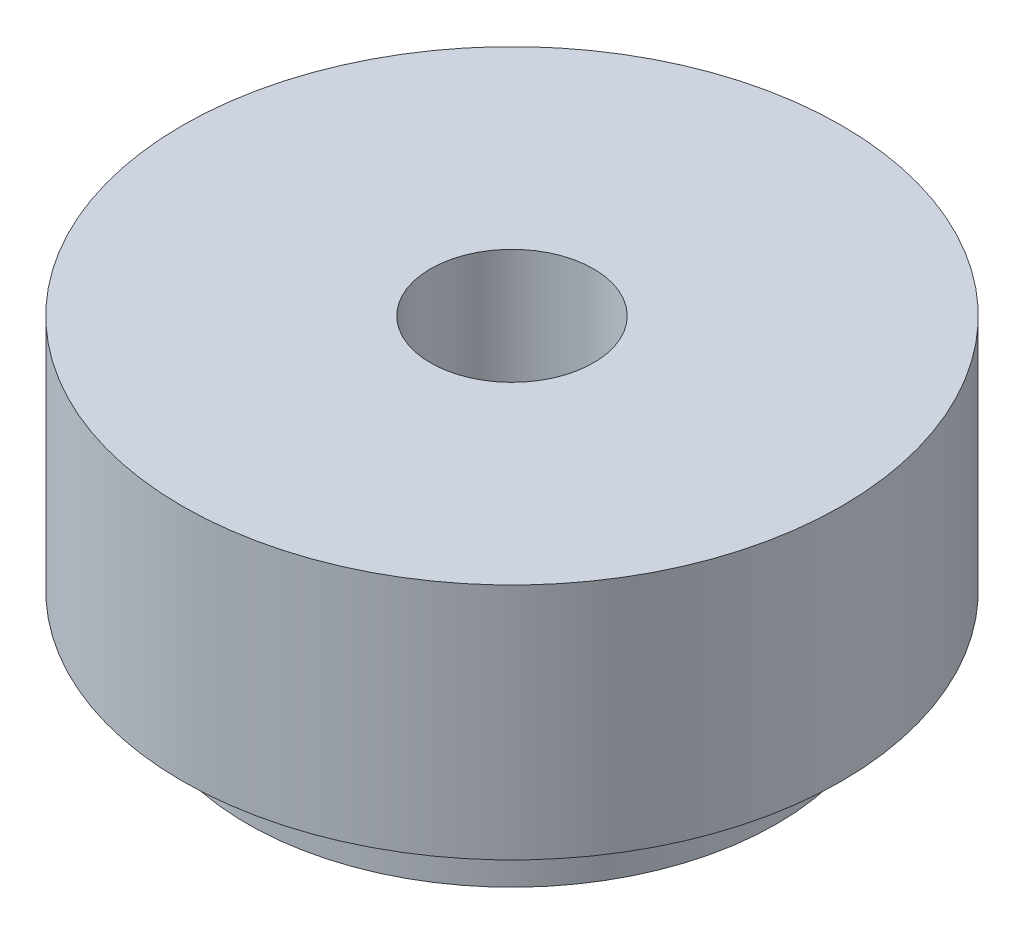
ISO-10303-21;
HEADER;
FILE_DESCRIPTION(('STEP AP214'),'2;1');
FILE_NAME('part.step','',(''),(''),'','','');
FILE_SCHEMA(('AUTOMOTIVE_DESIGN { 1 0 10303 214 1 1 1 1 }'));
ENDSEC;
DATA;
#1=APPLICATION_CONTEXT('core data for automotive mechanical design processes');
#2=APPLICATION_PROTOCOL_DEFINITION('international standard','automotive_design',2000,#1);
#3=PRODUCT_CONTEXT('',#1,'mechanical');
#4=PRODUCT('Part','Part','',(#3));
#5=PRODUCT_RELATED_PRODUCT_CATEGORY('part','',(#4));
#6=PRODUCT_DEFINITION_FORMATION('','',#4);
#7=PRODUCT_DEFINITION_CONTEXT('part definition',#1,'design');
#8=PRODUCT_DEFINITION('design','',#6,#7);
#9=PRODUCT_DEFINITION_SHAPE('','',#8);
#10=(LENGTH_UNIT() NAMED_UNIT(*) SI_UNIT(.MILLI.,.METRE.));
#11=(NAMED_UNIT(*) PLANE_ANGLE_UNIT() SI_UNIT($,.RADIAN.));
#12=(NAMED_UNIT(*) SI_UNIT($,.STERADIAN.) SOLID_ANGLE_UNIT());
#13=UNCERTAINTY_MEASURE_WITH_UNIT(LENGTH_MEASURE(1.E-05),#10,'distance_accuracy_value','');
#14=(GEOMETRIC_REPRESENTATION_CONTEXT(3) GLOBAL_UNCERTAINTY_ASSIGNED_CONTEXT((#13)) GLOBAL_UNIT_ASSIGNED_CONTEXT((#10,
#11,#12)) REPRESENTATION_CONTEXT('',''));
#15=CARTESIAN_POINT('',(0.,0.,0.));
#16=DIRECTION('',(0.,0.,1.));
#17=DIRECTION('',(1.,0.,0.));
#18=AXIS2_PLACEMENT_3D('',#15,#16,#17);
#19=CARTESIAN_POINT('',(0.,57.7437370761236,0.));
#20=DIRECTION('',(0.,1.,0.));
#21=DIRECTION('',(-1.,0.,0.));
#22=AXIS2_PLACEMENT_3D('',#19,#20,#21);
#23=CYLINDRICAL_SURFACE('',#22,3.6703);
#24=CARTESIAN_POINT('',(0.,0.,0.));
#25=DIRECTION('',(0.,1.,0.));
#26=DIRECTION('',(-1.,0.,0.));
#27=AXIS2_PLACEMENT_3D('',#24,#25,#26);
#28=CIRCLE('',#27,3.6703);
#29=CARTESIAN_POINT('',(-3.67029999999999,0.,0.));
#30=VERTEX_POINT('',#29);
#31=EDGE_CURVE('E55',#30,#30,#28,.T.);
#32=ORIENTED_EDGE('',*,*,#31,.F.);
#33=EDGE_LOOP('',(#32));
#34=FACE_BOUND('',#33,.T.);
#35=CARTESIAN_POINT('',(0.,-0.965199999999999,0.));
#36=DIRECTION('',(0.,1.,0.));
#37=DIRECTION('',(-1.,0.,0.));
#38=AXIS2_PLACEMENT_3D('',#35,#36,#37);
#39=CIRCLE('',#38,3.6703);
#40=CARTESIAN_POINT('',(-3.67029999999999,-0.9652,0.));
#41=VERTEX_POINT('',#40);
#42=EDGE_CURVE('E10',#41,#41,#39,.T.);
#43=ORIENTED_EDGE('',*,*,#42,.T.);
#44=EDGE_LOOP('',(#43));
#45=FACE_BOUND('',#44,.T.);
#46=ADVANCED_FACE('F33',(#34,#45),#23,.T.);
#47=CARTESIAN_POINT('',(3.67030000000001,-0.9652,0.));
#48=DIRECTION('',(0.,1.,0.));
#49=DIRECTION('',(-1.,0.,0.));
#50=AXIS2_PLACEMENT_3D('',#47,#48,#49);
#51=PLANE('',#50);
#52=ORIENTED_EDGE('',*,*,#42,.F.);
#53=EDGE_LOOP('',(#52));
#54=FACE_BOUND('',#53,.T.);
#55=CARTESIAN_POINT('',(0.,-0.965199999999999,0.));
#56=DIRECTION('',(0.,1.,0.));
#57=DIRECTION('',(-1.,0.,0.));
#58=AXIS2_PLACEMENT_3D('',#55,#56,#57);
#59=CIRCLE('',#58,1.1303);
#60=CARTESIAN_POINT('',(-1.13029999999999,-0.9652,0.));
#61=VERTEX_POINT('',#60);
#62=EDGE_CURVE('E39',#61,#61,#59,.T.);
#63=ORIENTED_EDGE('',*,*,#62,.T.);
#64=EDGE_LOOP('',(#63));
#65=FACE_BOUND('',#64,.T.);
#66=ADVANCED_FACE('F62',(#54,#65),#51,.F.);
#67=CARTESIAN_POINT('',(0.,57.7437370761236,0.));
#68=DIRECTION('',(0.,1.,0.));
#69=DIRECTION('',(-1.,0.,0.));
#70=AXIS2_PLACEMENT_3D('',#67,#68,#69);
#71=CYLINDRICAL_SURFACE('',#70,1.1303);
#72=ORIENTED_EDGE('',*,*,#62,.F.);
#73=EDGE_LOOP('',(#72));
#74=FACE_BOUND('',#73,.T.);
#75=CARTESIAN_POINT('',(0.,3.302,0.));
#76=DIRECTION('',(0.,1.,0.));
#77=DIRECTION('',(-1.,0.,0.));
#78=AXIS2_PLACEMENT_3D('',#75,#76,#77);
#79=CIRCLE('',#78,1.1303);
#80=CARTESIAN_POINT('',(-1.13029999999999,3.302,0.));
#81=VERTEX_POINT('',#80);
#82=EDGE_CURVE('E43',#81,#81,#79,.T.);
#83=ORIENTED_EDGE('',*,*,#82,.T.);
#84=EDGE_LOOP('',(#83));
#85=FACE_BOUND('',#84,.T.);
#86=ADVANCED_FACE('F66',(#74,#85),#71,.F.);
#87=CARTESIAN_POINT('',(1.13030000000001,3.302,0.));
#88=DIRECTION('',(0.,-1.,0.));
#89=DIRECTION('',(1.,0.,0.));
#90=AXIS2_PLACEMENT_3D('',#87,#88,#89);
#91=PLANE('',#90);
#92=ORIENTED_EDGE('',*,*,#82,.F.);
#93=EDGE_LOOP('',(#92));
#94=FACE_BOUND('',#93,.T.);
#95=CARTESIAN_POINT('',(0.,3.302,0.));
#96=DIRECTION('',(0.,1.,0.));
#97=DIRECTION('',(-1.,0.,0.));
#98=AXIS2_PLACEMENT_3D('',#95,#96,#97);
#99=CIRCLE('',#98,4.572);
#100=CARTESIAN_POINT('',(-4.572,3.302,0.));
#101=VERTEX_POINT('',#100);
#102=EDGE_CURVE('E47',#101,#101,#99,.T.);
#103=ORIENTED_EDGE('',*,*,#102,.T.);
#104=EDGE_LOOP('',(#103));
#105=FACE_BOUND('',#104,.T.);
#106=ADVANCED_FACE('F71',(#94,#105),#91,.F.);
#107=CARTESIAN_POINT('',(0.,57.7437370761236,0.));
#108=DIRECTION('',(0.,1.,0.));
#109=DIRECTION('',(-1.,0.,0.));
#110=AXIS2_PLACEMENT_3D('',#107,#108,#109);
#111=CYLINDRICAL_SURFACE('',#110,4.572);
#112=ORIENTED_EDGE('',*,*,#102,.F.);
#113=EDGE_LOOP('',(#112));
#114=FACE_BOUND('',#113,.T.);
#115=CARTESIAN_POINT('',(0.,0.,0.));
#116=DIRECTION('',(0.,1.,0.));
#117=DIRECTION('',(-1.,0.,0.));
#118=AXIS2_PLACEMENT_3D('',#115,#116,#117);
#119=CIRCLE('',#118,4.572);
#120=CARTESIAN_POINT('',(-4.57199999999999,0.,0.));
#121=VERTEX_POINT('',#120);
#122=EDGE_CURVE('E52',#121,#121,#119,.T.);
#123=ORIENTED_EDGE('',*,*,#122,.T.);
#124=EDGE_LOOP('',(#123));
#125=FACE_BOUND('',#124,.T.);
#126=ADVANCED_FACE('F77',(#114,#125),#111,.T.);
#127=CARTESIAN_POINT('',(3.67030000000001,0.,0.));
#128=DIRECTION('',(0.,1.,0.));
#129=DIRECTION('',(-1.,0.,0.));
#130=AXIS2_PLACEMENT_3D('',#127,#128,#129);
#131=PLANE('',#130);
#132=ORIENTED_EDGE('',*,*,#122,.F.);
#133=EDGE_LOOP('',(#132));
#134=FACE_BOUND('',#133,.T.);
#135=ORIENTED_EDGE('',*,*,#31,.T.);
#136=EDGE_LOOP('',(#135));
#137=FACE_BOUND('',#136,.T.);
#138=ADVANCED_FACE('F59',(#134,#137),#131,.F.);
#139=CLOSED_SHELL('',(#46,#66,#86,#106,#126,#138));
#140=MANIFOLD_SOLID_BREP('B2',#139);
#141=ADVANCED_BREP_SHAPE_REPRESENTATION('',(#18,#140),#14);
#142=SHAPE_DEFINITION_REPRESENTATION(#9,#141);
ENDSEC;
END-ISO-10303-21;
